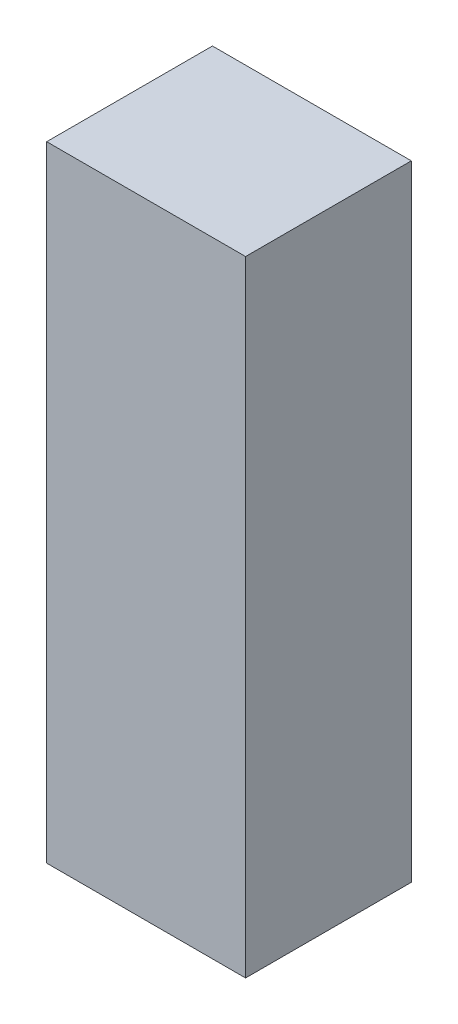
ISO-10303-21;
HEADER;
FILE_DESCRIPTION(('STEP AP214'),'2;1');
FILE_NAME('part.step','',(''),(''),'','','');
FILE_SCHEMA(('AUTOMOTIVE_DESIGN { 1 0 10303 214 1 1 1 1 }'));
ENDSEC;
DATA;
#1=APPLICATION_CONTEXT('core data for automotive mechanical design processes');
#2=APPLICATION_PROTOCOL_DEFINITION('international standard','automotive_design',2000,#1);
#3=PRODUCT_CONTEXT('',#1,'mechanical');
#4=PRODUCT('Part','Part','',(#3));
#5=PRODUCT_RELATED_PRODUCT_CATEGORY('part','',(#4));
#6=PRODUCT_DEFINITION_FORMATION('','',#4);
#7=PRODUCT_DEFINITION_CONTEXT('part definition',#1,'design');
#8=PRODUCT_DEFINITION('design','',#6,#7);
#9=PRODUCT_DEFINITION_SHAPE('','',#8);
#10=(LENGTH_UNIT() NAMED_UNIT(*) SI_UNIT(.MILLI.,.METRE.));
#11=(NAMED_UNIT(*) PLANE_ANGLE_UNIT() SI_UNIT($,.RADIAN.));
#12=(NAMED_UNIT(*) SI_UNIT($,.STERADIAN.) SOLID_ANGLE_UNIT());
#13=UNCERTAINTY_MEASURE_WITH_UNIT(LENGTH_MEASURE(1.E-05),#10,'distance_accuracy_value','');
#14=(GEOMETRIC_REPRESENTATION_CONTEXT(3) GLOBAL_UNCERTAINTY_ASSIGNED_CONTEXT((#13)) GLOBAL_UNIT_ASSIGNED_CONTEXT((#10,
#11,#12)) REPRESENTATION_CONTEXT('',''));
#15=CARTESIAN_POINT('',(0.,0.,0.));
#16=DIRECTION('',(0.,0.,1.));
#17=DIRECTION('',(1.,0.,0.));
#18=AXIS2_PLACEMENT_3D('',#15,#16,#17);
#19=CARTESIAN_POINT('',(0.,0.,10.));
#20=DIRECTION('',(1.,0.,0.));
#21=DIRECTION('',(0.,0.,-1.));
#22=AXIS2_PLACEMENT_3D('',#19,#20,#21);
#23=PLANE('',#22);
#24=DIRECTION('',(0.,-1.,0.));
#25=VECTOR('',#24,1.);
#26=CARTESIAN_POINT('',(0.,0.,0.));
#27=LINE('',#26,#25);
#28=CARTESIAN_POINT('',(0.,37.699,0.));
#29=VERTEX_POINT('',#28);
#30=CARTESIAN_POINT('',(0.,0.,0.));
#31=VERTEX_POINT('',#30);
#32=EDGE_CURVE('E99',#29,#31,#27,.T.);
#33=ORIENTED_EDGE('',*,*,#32,.T.);
#34=DIRECTION('',(0.,0.,-1.));
#35=VECTOR('',#34,1.);
#36=CARTESIAN_POINT('',(0.,0.,10.));
#37=LINE('',#36,#35);
#38=CARTESIAN_POINT('',(0.,0.,10.));
#39=VERTEX_POINT('',#38);
#40=EDGE_CURVE('E11',#39,#31,#37,.T.);
#41=ORIENTED_EDGE('',*,*,#40,.F.);
#42=DIRECTION('',(0.,-1.,0.));
#43=VECTOR('',#42,1.);
#44=CARTESIAN_POINT('',(0.,0.,10.));
#45=LINE('',#44,#43);
#46=CARTESIAN_POINT('',(0.,37.699,10.));
#47=VERTEX_POINT('',#46);
#48=EDGE_CURVE('E87',#47,#39,#45,.T.);
#49=ORIENTED_EDGE('',*,*,#48,.F.);
#50=DIRECTION('',(0.,0.,-1.));
#51=VECTOR('',#50,1.);
#52=CARTESIAN_POINT('',(0.,37.699,10.));
#53=LINE('',#52,#51);
#54=EDGE_CURVE('E95',#47,#29,#53,.T.);
#55=ORIENTED_EDGE('',*,*,#54,.T.);
#56=EDGE_LOOP('',(#33,#41,#49,#55));
#57=FACE_BOUND('',#56,.T.);
#58=ADVANCED_FACE('F36',(#57),#23,.F.);
#59=CARTESIAN_POINT('',(0.,0.,10.));
#60=DIRECTION('',(0.,1.,0.));
#61=DIRECTION('',(-1.,0.,0.));
#62=AXIS2_PLACEMENT_3D('',#59,#60,#61);
#63=PLANE('',#62);
#64=DIRECTION('',(1.,0.,0.));
#65=VECTOR('',#64,1.);
#66=CARTESIAN_POINT('',(0.,0.,0.));
#67=LINE('',#66,#65);
#68=CARTESIAN_POINT('',(12.,0.,0.));
#69=VERTEX_POINT('',#68);
#70=EDGE_CURVE('E91',#31,#69,#67,.T.);
#71=ORIENTED_EDGE('',*,*,#70,.T.);
#72=DIRECTION('',(0.,0.,-1.));
#73=VECTOR('',#72,1.);
#74=CARTESIAN_POINT('',(12.,0.,10.));
#75=LINE('',#74,#73);
#76=CARTESIAN_POINT('',(12.,0.,10.));
#77=VERTEX_POINT('',#76);
#78=EDGE_CURVE('E44',#77,#69,#75,.T.);
#79=ORIENTED_EDGE('',*,*,#78,.F.);
#80=DIRECTION('',(1.,0.,0.));
#81=VECTOR('',#80,1.);
#82=CARTESIAN_POINT('',(0.,0.,10.));
#83=LINE('',#82,#81);
#84=EDGE_CURVE('E82',#39,#77,#83,.T.);
#85=ORIENTED_EDGE('',*,*,#84,.F.);
#86=ORIENTED_EDGE('',*,*,#40,.T.);
#87=EDGE_LOOP('',(#71,#79,#85,#86));
#88=FACE_BOUND('',#87,.T.);
#89=ADVANCED_FACE('F90',(#88),#63,.F.);
#90=CARTESIAN_POINT('',(12.,0.,10.));
#91=DIRECTION('',(-1.,0.,0.));
#92=DIRECTION('',(0.,-1.,0.));
#93=AXIS2_PLACEMENT_3D('',#90,#91,#92);
#94=PLANE('',#93);
#95=DIRECTION('',(0.,1.,0.));
#96=VECTOR('',#95,1.);
#97=CARTESIAN_POINT('',(12.,0.,0.));
#98=LINE('',#97,#96);
#99=CARTESIAN_POINT('',(12.,37.699,0.));
#100=VERTEX_POINT('',#99);
#101=EDGE_CURVE('E69',#69,#100,#98,.T.);
#102=ORIENTED_EDGE('',*,*,#101,.T.);
#103=DIRECTION('',(0.,0.,-1.));
#104=VECTOR('',#103,1.);
#105=CARTESIAN_POINT('',(12.,37.699,10.));
#106=LINE('',#105,#104);
#107=CARTESIAN_POINT('',(12.,37.699,10.));
#108=VERTEX_POINT('',#107);
#109=EDGE_CURVE('E92',#108,#100,#106,.T.);
#110=ORIENTED_EDGE('',*,*,#109,.F.);
#111=DIRECTION('',(0.,1.,0.));
#112=VECTOR('',#111,1.);
#113=CARTESIAN_POINT('',(12.,0.,10.));
#114=LINE('',#113,#112);
#115=EDGE_CURVE('E85',#77,#108,#114,.T.);
#116=ORIENTED_EDGE('',*,*,#115,.F.);
#117=ORIENTED_EDGE('',*,*,#78,.T.);
#118=EDGE_LOOP('',(#102,#110,#116,#117));
#119=FACE_BOUND('',#118,.T.);
#120=ADVANCED_FACE('F93',(#119),#94,.F.);
#121=CARTESIAN_POINT('',(0.,37.699,10.));
#122=DIRECTION('',(0.,-1.,0.));
#123=DIRECTION('',(0.,0.,-1.));
#124=AXIS2_PLACEMENT_3D('',#121,#122,#123);
#125=PLANE('',#124);
#126=DIRECTION('',(-1.,0.,0.));
#127=VECTOR('',#126,1.);
#128=CARTESIAN_POINT('',(0.,37.699,0.));
#129=LINE('',#128,#127);
#130=EDGE_CURVE('E75',#100,#29,#129,.T.);
#131=ORIENTED_EDGE('',*,*,#130,.T.);
#132=ORIENTED_EDGE('',*,*,#54,.F.);
#133=DIRECTION('',(-1.,0.,0.));
#134=VECTOR('',#133,1.);
#135=CARTESIAN_POINT('',(0.,37.699,10.));
#136=LINE('',#135,#134);
#137=EDGE_CURVE('E52',#108,#47,#136,.T.);
#138=ORIENTED_EDGE('',*,*,#137,.F.);
#139=ORIENTED_EDGE('',*,*,#109,.T.);
#140=EDGE_LOOP('',(#131,#132,#138,#139));
#141=FACE_BOUND('',#140,.T.);
#142=ADVANCED_FACE('F106',(#141),#125,.F.);
#143=CARTESIAN_POINT('',(0.,0.,10.));
#144=DIRECTION('',(0.,0.,-1.));
#145=DIRECTION('',(-1.,0.,0.));
#146=AXIS2_PLACEMENT_3D('',#143,#144,#145);
#147=PLANE('',#146);
#148=ORIENTED_EDGE('',*,*,#48,.T.);
#149=ORIENTED_EDGE('',*,*,#84,.T.);
#150=ORIENTED_EDGE('',*,*,#115,.T.);
#151=ORIENTED_EDGE('',*,*,#137,.T.);
#152=EDGE_LOOP('',(#148,#149,#150,#151));
#153=FACE_BOUND('',#152,.T.);
#154=ADVANCED_FACE('F83',(#153),#147,.F.);
#155=CARTESIAN_POINT('',(0.,0.,0.));
#156=DIRECTION('',(0.,0.,-1.));
#157=DIRECTION('',(-1.,0.,0.));
#158=AXIS2_PLACEMENT_3D('',#155,#156,#157);
#159=PLANE('',#158);
#160=ORIENTED_EDGE('',*,*,#32,.F.);
#161=ORIENTED_EDGE('',*,*,#130,.F.);
#162=ORIENTED_EDGE('',*,*,#101,.F.);
#163=ORIENTED_EDGE('',*,*,#70,.F.);
#164=EDGE_LOOP('',(#160,#161,#162,#163));
#165=FACE_BOUND('',#164,.T.);
#166=ADVANCED_FACE('F109',(#165),#159,.T.);
#167=CLOSED_SHELL('',(#58,#89,#120,#142,#154,#166));
#168=MANIFOLD_SOLID_BREP('B2',#167);
#169=ADVANCED_BREP_SHAPE_REPRESENTATION('',(#18,#168),#14);
#170=SHAPE_DEFINITION_REPRESENTATION(#9,#169);
ENDSEC;
END-ISO-10303-21;
